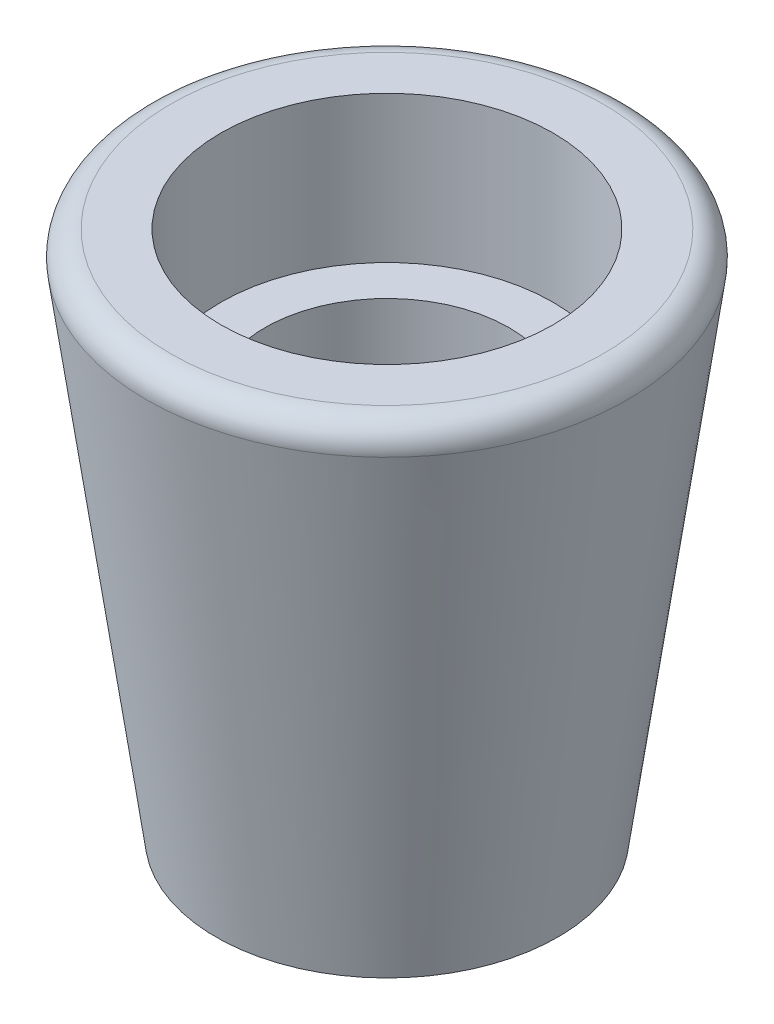
ISO-10303-21;
HEADER;
FILE_DESCRIPTION(('STEP AP214'),'2;1');
FILE_NAME('part.step','',(''),(''),'','','');
FILE_SCHEMA(('AUTOMOTIVE_DESIGN { 1 0 10303 214 1 1 1 1 }'));
ENDSEC;
DATA;
#1=APPLICATION_CONTEXT('core data for automotive mechanical design processes');
#2=APPLICATION_PROTOCOL_DEFINITION('international standard','automotive_design',2000,#1);
#3=PRODUCT_CONTEXT('',#1,'mechanical');
#4=PRODUCT('Part','Part','',(#3));
#5=PRODUCT_RELATED_PRODUCT_CATEGORY('part','',(#4));
#6=PRODUCT_DEFINITION_FORMATION('','',#4);
#7=PRODUCT_DEFINITION_CONTEXT('part definition',#1,'design');
#8=PRODUCT_DEFINITION('design','',#6,#7);
#9=PRODUCT_DEFINITION_SHAPE('','',#8);
#10=(LENGTH_UNIT() NAMED_UNIT(*) SI_UNIT(.MILLI.,.METRE.));
#11=(NAMED_UNIT(*) PLANE_ANGLE_UNIT() SI_UNIT($,.RADIAN.));
#12=(NAMED_UNIT(*) SI_UNIT($,.STERADIAN.) SOLID_ANGLE_UNIT());
#13=UNCERTAINTY_MEASURE_WITH_UNIT(LENGTH_MEASURE(1.E-05),#10,'distance_accuracy_value','');
#14=(GEOMETRIC_REPRESENTATION_CONTEXT(3) GLOBAL_UNCERTAINTY_ASSIGNED_CONTEXT((#13)) GLOBAL_UNIT_ASSIGNED_CONTEXT((#10,
#11,#12)) REPRESENTATION_CONTEXT('',''));
#15=CARTESIAN_POINT('',(0.,0.,0.));
#16=DIRECTION('',(0.,0.,1.));
#17=DIRECTION('',(1.,0.,0.));
#18=AXIS2_PLACEMENT_3D('',#15,#16,#17);
#19=CARTESIAN_POINT('',(0.,0.,0.));
#20=DIRECTION('',(0.,-1.,0.));
#21=DIRECTION('',(0.,0.,-1.));
#22=AXIS2_PLACEMENT_3D('',#19,#20,#21);
#23=CYLINDRICAL_SURFACE('',#22,2.5);
#24=CARTESIAN_POINT('',(0.,0.,0.));
#25=DIRECTION('',(0.,-1.,0.));
#26=DIRECTION('',(0.,0.,-1.));
#27=AXIS2_PLACEMENT_3D('',#24,#25,#26);
#28=CIRCLE('',#27,2.5);
#29=CARTESIAN_POINT('',(0.,0.,-2.5));
#30=VERTEX_POINT('',#29);
#31=EDGE_CURVE('E50',#30,#30,#28,.T.);
#32=ORIENTED_EDGE('',*,*,#31,.T.);
#33=EDGE_LOOP('',(#32));
#34=FACE_BOUND('',#33,.T.);
#35=CARTESIAN_POINT('',(0.,7.8,0.));
#36=DIRECTION('',(0.,-1.,0.));
#37=DIRECTION('',(0.,0.,-1.));
#38=AXIS2_PLACEMENT_3D('',#35,#36,#37);
#39=CIRCLE('',#38,2.5);
#40=CARTESIAN_POINT('',(0.,7.8,-2.5));
#41=VERTEX_POINT('',#40);
#42=EDGE_CURVE('E69',#41,#41,#39,.T.);
#43=ORIENTED_EDGE('',*,*,#42,.F.);
#44=EDGE_LOOP('',(#43));
#45=FACE_BOUND('',#44,.T.);
#46=ADVANCED_FACE('F37',(#34,#45),#23,.F.);
#47=CARTESIAN_POINT('',(2.5,0.,0.));
#48=DIRECTION('',(0.,-1.,0.));
#49=DIRECTION('',(0.,0.,-1.));
#50=AXIS2_PLACEMENT_3D('',#47,#48,#49);
#51=PLANE('',#50);
#52=CARTESIAN_POINT('',(0.,0.,0.));
#53=DIRECTION('',(0.,-1.,0.));
#54=DIRECTION('',(0.,0.,-1.));
#55=AXIS2_PLACEMENT_3D('',#52,#53,#54);
#56=CIRCLE('',#55,3.5);
#57=CARTESIAN_POINT('',(0.,0.,-3.5));
#58=VERTEX_POINT('',#57);
#59=EDGE_CURVE('E55',#58,#58,#56,.T.);
#60=ORIENTED_EDGE('',*,*,#59,.T.);
#61=EDGE_LOOP('',(#60));
#62=FACE_BOUND('',#61,.T.);
#63=ORIENTED_EDGE('',*,*,#31,.F.);
#64=EDGE_LOOP('',(#63));
#65=FACE_BOUND('',#64,.T.);
#66=ADVANCED_FACE('F78',(#62,#65),#51,.T.);
#67=CARTESIAN_POINT('',(0.,0.,0.));
#68=DIRECTION('',(0.,1.,0.));
#69=DIRECTION('',(0.,0.,1.));
#70=AXIS2_PLACEMENT_3D('',#67,#68,#69);
#71=CONICAL_SURFACE('',#70,3.5,0.138006023657519);
#72=CARTESIAN_POINT('',(0.,10.2312158143627,0.));
#73=DIRECTION('',(0.,-1.,0.));
#74=DIRECTION('',(0.,0.,-1.));
#75=AXIS2_PLACEMENT_3D('',#72,#73,#74);
#76=CIRCLE('',#75,4.92100219643926);
#77=CARTESIAN_POINT('',(0.,10.2312158143627,-4.92100219643926));
#78=VERTEX_POINT('',#77);
#79=EDGE_CURVE('E45',#78,#78,#76,.T.);
#80=ORIENTED_EDGE('',*,*,#79,.T.);
#81=EDGE_LOOP('',(#80));
#82=FACE_BOUND('',#81,.T.);
#83=ORIENTED_EDGE('',*,*,#59,.F.);
#84=EDGE_LOOP('',(#83));
#85=FACE_BOUND('',#84,.T.);
#86=ADVANCED_FACE('F83',(#82,#85),#71,.T.);
#87=CARTESIAN_POINT('',(5.,10.8,0.));
#88=DIRECTION('',(0.,1.,0.));
#89=DIRECTION('',(0.,0.,1.));
#90=AXIS2_PLACEMENT_3D('',#87,#88,#89);
#91=PLANE('',#90);
#92=CARTESIAN_POINT('',(0.,10.8,0.));
#93=DIRECTION('',(0.,1.,0.));
#94=DIRECTION('',(0.,0.,1.));
#95=AXIS2_PLACEMENT_3D('',#92,#93,#94);
#96=CIRCLE('',#95,4.42575605985038);
#97=CARTESIAN_POINT('',(0.,10.8,4.42575605985038));
#98=VERTEX_POINT('',#97);
#99=EDGE_CURVE('E10',#98,#98,#96,.T.);
#100=ORIENTED_EDGE('',*,*,#99,.T.);
#101=EDGE_LOOP('',(#100));
#102=FACE_BOUND('',#101,.T.);
#103=CARTESIAN_POINT('',(0.,10.8,0.));
#104=DIRECTION('',(0.,-1.,0.));
#105=DIRECTION('',(0.,0.,-1.));
#106=AXIS2_PLACEMENT_3D('',#103,#104,#105);
#107=CIRCLE('',#106,3.4);
#108=CARTESIAN_POINT('',(0.,10.8,-3.4));
#109=VERTEX_POINT('',#108);
#110=EDGE_CURVE('E61',#109,#109,#107,.T.);
#111=ORIENTED_EDGE('',*,*,#110,.T.);
#112=EDGE_LOOP('',(#111));
#113=FACE_BOUND('',#112,.T.);
#114=ADVANCED_FACE('F89',(#102,#113),#91,.T.);
#115=CARTESIAN_POINT('',(0.,0.,0.));
#116=DIRECTION('',(0.,-1.,0.));
#117=DIRECTION('',(0.,0.,-1.));
#118=AXIS2_PLACEMENT_3D('',#115,#116,#117);
#119=CYLINDRICAL_SURFACE('',#118,3.4);
#120=CARTESIAN_POINT('',(0.,7.8,0.));
#121=DIRECTION('',(0.,-1.,0.));
#122=DIRECTION('',(0.,0.,-1.));
#123=AXIS2_PLACEMENT_3D('',#120,#121,#122);
#124=CIRCLE('',#123,3.4);
#125=CARTESIAN_POINT('',(0.,7.8,-3.4));
#126=VERTEX_POINT('',#125);
#127=EDGE_CURVE('E65',#126,#126,#124,.T.);
#128=ORIENTED_EDGE('',*,*,#127,.T.);
#129=EDGE_LOOP('',(#128));
#130=FACE_BOUND('',#129,.T.);
#131=ORIENTED_EDGE('',*,*,#110,.F.);
#132=EDGE_LOOP('',(#131));
#133=FACE_BOUND('',#132,.T.);
#134=ADVANCED_FACE('F92',(#130,#133),#119,.F.);
#135=CARTESIAN_POINT('',(3.4,7.8,0.));
#136=DIRECTION('',(0.,1.,0.));
#137=DIRECTION('',(0.,0.,1.));
#138=AXIS2_PLACEMENT_3D('',#135,#136,#137);
#139=PLANE('',#138);
#140=ORIENTED_EDGE('',*,*,#42,.T.);
#141=EDGE_LOOP('',(#140));
#142=FACE_BOUND('',#141,.T.);
#143=ORIENTED_EDGE('',*,*,#127,.F.);
#144=EDGE_LOOP('',(#143));
#145=FACE_BOUND('',#144,.T.);
#146=ADVANCED_FACE('F74',(#142,#145),#139,.T.);
#147=CARTESIAN_POINT('',(0.,10.3,0.));
#148=DIRECTION('',(0.,1.,0.));
#149=DIRECTION('',(0.,0.,1.));
#150=AXIS2_PLACEMENT_3D('',#147,#148,#149);
#151=TOROIDAL_SURFACE('',#150,4.42575605985038,0.5);
#152=ORIENTED_EDGE('',*,*,#99,.F.);
#153=EDGE_LOOP('',(#152));
#154=FACE_BOUND('',#153,.T.);
#155=ORIENTED_EDGE('',*,*,#79,.F.);
#156=EDGE_LOOP('',(#155));
#157=FACE_BOUND('',#156,.T.);
#158=ADVANCED_FACE('F39',(#154,#157),#151,.T.);
#159=CLOSED_SHELL('',(#46,#66,#86,#114,#134,#146,#158));
#160=MANIFOLD_SOLID_BREP('B2',#159);
#161=ADVANCED_BREP_SHAPE_REPRESENTATION('',(#18,#160),#14);
#162=SHAPE_DEFINITION_REPRESENTATION(#9,#161);
ENDSEC;
END-ISO-10303-21;
